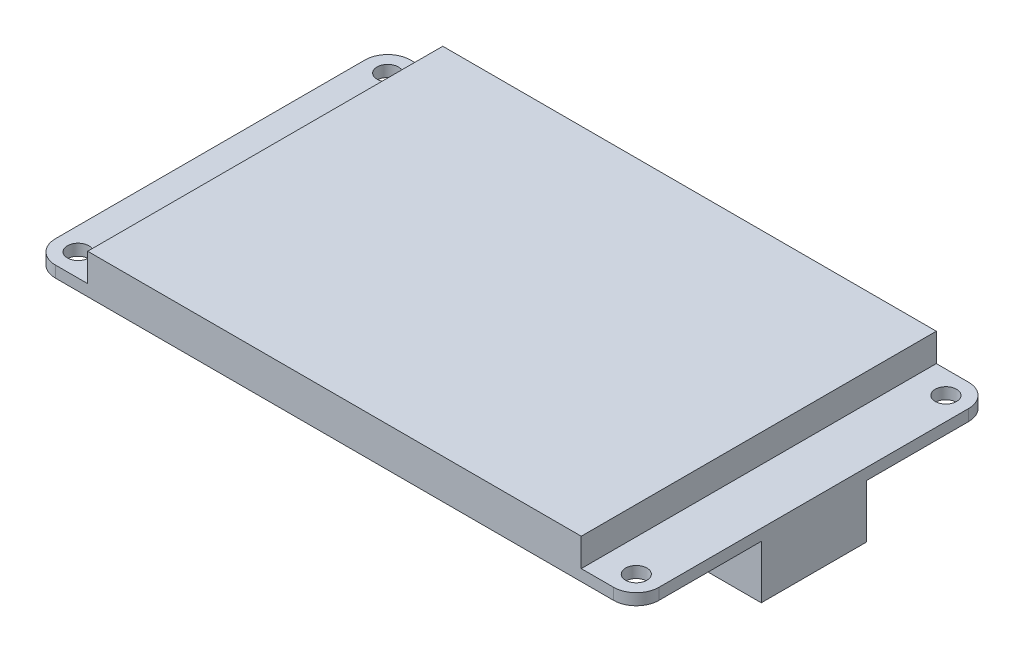
ISO-10303-21;
HEADER;
FILE_DESCRIPTION(('STEP AP214'),'2;1');
FILE_NAME('part.step','',(''),(''),'','','');
FILE_SCHEMA(('AUTOMOTIVE_DESIGN { 1 0 10303 214 1 1 1 1 }'));
ENDSEC;
DATA;
#1=APPLICATION_CONTEXT('core data for automotive mechanical design processes');
#2=APPLICATION_PROTOCOL_DEFINITION('international standard','automotive_design',2000,#1);
#3=PRODUCT_CONTEXT('',#1,'mechanical');
#4=PRODUCT('Part','Part','',(#3));
#5=PRODUCT_RELATED_PRODUCT_CATEGORY('part','',(#4));
#6=PRODUCT_DEFINITION_FORMATION('','',#4);
#7=PRODUCT_DEFINITION_CONTEXT('part definition',#1,'design');
#8=PRODUCT_DEFINITION('design','',#6,#7);
#9=PRODUCT_DEFINITION_SHAPE('','',#8);
#10=(LENGTH_UNIT() NAMED_UNIT(*) SI_UNIT(.MILLI.,.METRE.));
#11=(NAMED_UNIT(*) PLANE_ANGLE_UNIT() SI_UNIT($,.RADIAN.));
#12=(NAMED_UNIT(*) SI_UNIT($,.STERADIAN.) SOLID_ANGLE_UNIT());
#13=UNCERTAINTY_MEASURE_WITH_UNIT(LENGTH_MEASURE(1.E-05),#10,'distance_accuracy_value','');
#14=(GEOMETRIC_REPRESENTATION_CONTEXT(3) GLOBAL_UNCERTAINTY_ASSIGNED_CONTEXT((#13)) GLOBAL_UNIT_ASSIGNED_CONTEXT((#10,
#11,#12)) REPRESENTATION_CONTEXT('',''));
#15=CARTESIAN_POINT('',(0.,0.,0.));
#16=DIRECTION('',(0.,0.,1.));
#17=DIRECTION('',(1.,0.,0.));
#18=AXIS2_PLACEMENT_3D('',#15,#16,#17);
#19=CARTESIAN_POINT('',(0.,0.,0.));
#20=DIRECTION('',(0.,-1.,0.));
#21=DIRECTION('',(0.,0.,-1.));
#22=AXIS2_PLACEMENT_3D('',#19,#20,#21);
#23=PLANE('',#22);
#24=CARTESIAN_POINT('',(81.8,0.,-3.20000000000002));
#25=DIRECTION('',(0.,1.,0.));
#26=DIRECTION('',(0.,0.,1.));
#27=AXIS2_PLACEMENT_3D('',#24,#25,#26);
#28=CIRCLE('',#27,1.49999999999998);
#29=CARTESIAN_POINT('',(81.8,0.,-1.70000000000003));
#30=VERTEX_POINT('',#29);
#31=EDGE_CURVE('E257',#30,#30,#28,.T.);
#32=ORIENTED_EDGE('',*,*,#31,.T.);
#33=EDGE_LOOP('',(#32));
#34=FACE_BOUND('',#33,.T.);
#35=CARTESIAN_POINT('',(3.2,0.,-3.20000000000002));
#36=DIRECTION('',(0.,1.,0.));
#37=DIRECTION('',(0.,0.,-1.));
#38=AXIS2_PLACEMENT_3D('',#35,#36,#37);
#39=CIRCLE('',#38,1.5);
#40=CARTESIAN_POINT('',(3.2,0.,-4.70000000000002));
#41=VERTEX_POINT('',#40);
#42=EDGE_CURVE('E271',#41,#41,#39,.T.);
#43=ORIENTED_EDGE('',*,*,#42,.T.);
#44=EDGE_LOOP('',(#43));
#45=FACE_BOUND('',#44,.T.);
#46=CARTESIAN_POINT('',(81.8,0.,-46.8));
#47=DIRECTION('',(0.,1.,0.));
#48=DIRECTION('',(0.,0.,-1.));
#49=AXIS2_PLACEMENT_3D('',#46,#47,#48);
#50=CIRCLE('',#49,1.49999999999998);
#51=CARTESIAN_POINT('',(81.8,0.,-48.3));
#52=VERTEX_POINT('',#51);
#53=EDGE_CURVE('E241',#52,#52,#50,.T.);
#54=ORIENTED_EDGE('',*,*,#53,.T.);
#55=EDGE_LOOP('',(#54));
#56=FACE_BOUND('',#55,.T.);
#57=CARTESIAN_POINT('',(3.2,0.,-46.8));
#58=DIRECTION('',(0.,1.,0.));
#59=DIRECTION('',(0.,0.,1.));
#60=AXIS2_PLACEMENT_3D('',#57,#58,#59);
#61=CIRCLE('',#60,1.5);
#62=CARTESIAN_POINT('',(3.2,0.,-45.3));
#63=VERTEX_POINT('',#62);
#64=EDGE_CURVE('E299',#63,#63,#61,.T.);
#65=ORIENTED_EDGE('',*,*,#64,.T.);
#66=EDGE_LOOP('',(#65));
#67=FACE_BOUND('',#66,.T.);
#68=DIRECTION('',(1.,0.,0.));
#69=VECTOR('',#68,1.);
#70=CARTESIAN_POINT('',(31.0087140445048,0.,-20.4306303877755));
#71=LINE('',#70,#69);
#72=CARTESIAN_POINT('',(31.0087140445048,0.,-20.4306303877755));
#73=VERTEX_POINT('',#72);
#74=CARTESIAN_POINT('',(36.709115738963,0.,-20.4306303877755));
#75=VERTEX_POINT('',#74);
#76=EDGE_CURVE('E212',#73,#75,#71,.T.);
#77=ORIENTED_EDGE('',*,*,#76,.F.);
#78=DIRECTION('',(0.,0.,-1.));
#79=VECTOR('',#78,1.);
#80=CARTESIAN_POINT('',(31.0087140445048,0.,-3.32942530440073));
#81=LINE('',#80,#79);
#82=CARTESIAN_POINT('',(31.0087140445048,0.,-3.32942530440073));
#83=VERTEX_POINT('',#82);
#84=EDGE_CURVE('E209',#83,#73,#81,.T.);
#85=ORIENTED_EDGE('',*,*,#84,.F.);
#86=DIRECTION('',(-1.,0.,0.));
#87=VECTOR('',#86,1.);
#88=CARTESIAN_POINT('',(31.0087140445048,0.,-3.32942530440073));
#89=LINE('',#88,#87);
#90=CARTESIAN_POINT('',(36.709115738963,0.,-3.32942530440073));
#91=VERTEX_POINT('',#90);
#92=EDGE_CURVE('E222',#91,#83,#89,.T.);
#93=ORIENTED_EDGE('',*,*,#92,.F.);
#94=DIRECTION('',(0.,0.,1.));
#95=VECTOR('',#94,1.);
#96=CARTESIAN_POINT('',(36.709115738963,0.,-3.32942530440073));
#97=LINE('',#96,#95);
#98=EDGE_CURVE('E230',#75,#91,#97,.T.);
#99=ORIENTED_EDGE('',*,*,#98,.F.);
#100=EDGE_LOOP('',(#77,#85,#93,#99));
#101=FACE_BOUND('',#100,.T.);
#102=DIRECTION('',(0.,0.,-1.));
#103=VECTOR('',#102,1.);
#104=CARTESIAN_POINT('',(76.5,0.,-32.4));
#105=LINE('',#104,#103);
#106=CARTESIAN_POINT('',(76.5,0.,-17.6));
#107=VERTEX_POINT('',#106);
#108=CARTESIAN_POINT('',(76.5,0.,-32.4));
#109=VERTEX_POINT('',#108);
#110=EDGE_CURVE('E372',#107,#109,#105,.T.);
#111=ORIENTED_EDGE('',*,*,#110,.F.);
#112=DIRECTION('',(-1.,0.,0.));
#113=VECTOR('',#112,1.);
#114=CARTESIAN_POINT('',(85.,0.,-17.6));
#115=LINE('',#114,#113);
#116=CARTESIAN_POINT('',(85.,0.,-17.6));
#117=VERTEX_POINT('',#116);
#118=EDGE_CURVE('E371',#117,#107,#115,.T.);
#119=ORIENTED_EDGE('',*,*,#118,.F.);
#120=DIRECTION('',(0.,0.,-1.));
#121=VECTOR('',#120,1.);
#122=CARTESIAN_POINT('',(85.,0.,0.));
#123=LINE('',#122,#121);
#124=CARTESIAN_POINT('',(85.,0.,-3.20000000000002));
#125=VERTEX_POINT('',#124);
#126=EDGE_CURVE('E208',#125,#117,#123,.T.);
#127=ORIENTED_EDGE('',*,*,#126,.F.);
#128=CARTESIAN_POINT('',(81.8,0.,-3.20000000000002));
#129=DIRECTION('',(0.,-1.,0.));
#130=DIRECTION('',(0.,0.,1.));
#131=AXIS2_PLACEMENT_3D('',#128,#129,#130);
#132=CIRCLE('',#131,3.20000000000001);
#133=CARTESIAN_POINT('',(81.8,0.,0.));
#134=VERTEX_POINT('',#133);
#135=EDGE_CURVE('E251',#125,#134,#132,.T.);
#136=ORIENTED_EDGE('',*,*,#135,.T.);
#137=DIRECTION('',(1.,0.,0.));
#138=VECTOR('',#137,1.);
#139=CARTESIAN_POINT('',(0.,0.,0.));
#140=LINE('',#139,#138);
#141=CARTESIAN_POINT('',(3.20000000000001,0.,0.));
#142=VERTEX_POINT('',#141);
#143=EDGE_CURVE('E344',#142,#134,#140,.T.);
#144=ORIENTED_EDGE('',*,*,#143,.F.);
#145=CARTESIAN_POINT('',(3.2,0.,-3.20000000000002));
#146=DIRECTION('',(0.,-1.,0.));
#147=DIRECTION('',(0.,0.,-1.));
#148=AXIS2_PLACEMENT_3D('',#145,#146,#147);
#149=CIRCLE('',#148,3.2);
#150=CARTESIAN_POINT('',(0.,0.,-3.20000000000002));
#151=VERTEX_POINT('',#150);
#152=EDGE_CURVE('E294',#142,#151,#149,.T.);
#153=ORIENTED_EDGE('',*,*,#152,.T.);
#154=DIRECTION('',(0.,0.,1.));
#155=VECTOR('',#154,1.);
#156=CARTESIAN_POINT('',(0.,0.,0.));
#157=LINE('',#156,#155);
#158=CARTESIAN_POINT('',(0.,0.,-46.8));
#159=VERTEX_POINT('',#158);
#160=EDGE_CURVE('E323',#159,#151,#157,.T.);
#161=ORIENTED_EDGE('',*,*,#160,.F.);
#162=CARTESIAN_POINT('',(3.2,0.,-46.8));
#163=DIRECTION('',(0.,-1.,0.));
#164=DIRECTION('',(0.,0.,1.));
#165=AXIS2_PLACEMENT_3D('',#162,#163,#164);
#166=CIRCLE('',#165,3.2);
#167=CARTESIAN_POINT('',(3.20000000000001,0.,-50.));
#168=VERTEX_POINT('',#167);
#169=EDGE_CURVE('E282',#159,#168,#166,.T.);
#170=ORIENTED_EDGE('',*,*,#169,.T.);
#171=DIRECTION('',(-1.,0.,0.));
#172=VECTOR('',#171,1.);
#173=CARTESIAN_POINT('',(0.,0.,-50.));
#174=LINE('',#173,#172);
#175=CARTESIAN_POINT('',(81.8,0.,-50.));
#176=VERTEX_POINT('',#175);
#177=EDGE_CURVE('E49',#176,#168,#174,.T.);
#178=ORIENTED_EDGE('',*,*,#177,.F.);
#179=CARTESIAN_POINT('',(81.8,0.,-46.8));
#180=DIRECTION('',(0.,-1.,0.));
#181=DIRECTION('',(0.,0.,-1.));
#182=AXIS2_PLACEMENT_3D('',#179,#180,#181);
#183=CIRCLE('',#182,3.20000000000001);
#184=CARTESIAN_POINT('',(85.,0.,-46.8));
#185=VERTEX_POINT('',#184);
#186=EDGE_CURVE('E262',#176,#185,#183,.T.);
#187=ORIENTED_EDGE('',*,*,#186,.T.);
#188=CARTESIAN_POINT('',(85.,0.,-32.4));
#189=VERTEX_POINT('',#188);
#190=EDGE_CURVE('E346',#189,#185,#123,.T.);
#191=ORIENTED_EDGE('',*,*,#190,.F.);
#192=DIRECTION('',(1.,0.,0.));
#193=VECTOR('',#192,1.);
#194=CARTESIAN_POINT('',(85.,0.,-32.4));
#195=LINE('',#194,#193);
#196=EDGE_CURVE('E201',#109,#189,#195,.T.);
#197=ORIENTED_EDGE('',*,*,#196,.F.);
#198=EDGE_LOOP('',(#111,#119,#127,#136,#144,#153,#161,#170,#178,#187,#191,#197));
#199=FACE_BOUND('',#198,.T.);
#200=ADVANCED_FACE('F45',(#34,#45,#56,#67,#101,#199),#23,.T.);
#201=CARTESIAN_POINT('',(0.,5.55,0.));
#202=DIRECTION('',(1.,0.,0.));
#203=DIRECTION('',(0.,0.,-1.));
#204=AXIS2_PLACEMENT_3D('',#201,#202,#203);
#205=PLANE('',#204);
#206=DIRECTION('',(0.,1.,0.));
#207=VECTOR('',#206,1.);
#208=CARTESIAN_POINT('',(0.,0.,-3.20000000000002));
#209=LINE('',#208,#207);
#210=CARTESIAN_POINT('',(0.,1.6,-3.20000000000002));
#211=VERTEX_POINT('',#210);
#212=EDGE_CURVE('E291',#151,#211,#209,.T.);
#213=ORIENTED_EDGE('',*,*,#212,.T.);
#214=DIRECTION('',(0.,0.,1.));
#215=VECTOR('',#214,1.);
#216=CARTESIAN_POINT('',(0.,1.6,-50.));
#217=LINE('',#216,#215);
#218=CARTESIAN_POINT('',(0.,1.6,-46.8));
#219=VERTEX_POINT('',#218);
#220=EDGE_CURVE('E311',#219,#211,#217,.T.);
#221=ORIENTED_EDGE('',*,*,#220,.F.);
#222=DIRECTION('',(0.,1.,0.));
#223=VECTOR('',#222,1.);
#224=CARTESIAN_POINT('',(0.,0.,-46.8));
#225=LINE('',#224,#223);
#226=EDGE_CURVE('E283',#159,#219,#225,.T.);
#227=ORIENTED_EDGE('',*,*,#226,.F.);
#228=ORIENTED_EDGE('',*,*,#160,.T.);
#229=EDGE_LOOP('',(#213,#221,#227,#228));
#230=FACE_BOUND('',#229,.T.);
#231=ADVANCED_FACE('F47',(#230),#205,.F.);
#232=CARTESIAN_POINT('',(0.,5.55,0.));
#233=DIRECTION('',(0.,0.,-1.));
#234=DIRECTION('',(-1.,0.,0.));
#235=AXIS2_PLACEMENT_3D('',#232,#233,#234);
#236=PLANE('',#235);
#237=DIRECTION('',(1.,0.,0.));
#238=VECTOR('',#237,1.);
#239=CARTESIAN_POINT('',(0.,1.6,0.));
#240=LINE('',#239,#238);
#241=CARTESIAN_POINT('',(3.20000000000001,1.6,0.));
#242=VERTEX_POINT('',#241);
#243=CARTESIAN_POINT('',(7.75,1.6,0.));
#244=VERTEX_POINT('',#243);
#245=EDGE_CURVE('E316',#242,#244,#240,.T.);
#246=ORIENTED_EDGE('',*,*,#245,.F.);
#247=DIRECTION('',(0.,1.,0.));
#248=VECTOR('',#247,1.);
#249=CARTESIAN_POINT('',(3.20000000000001,0.,0.));
#250=LINE('',#249,#248);
#251=EDGE_CURVE('E270',#142,#242,#250,.T.);
#252=ORIENTED_EDGE('',*,*,#251,.F.);
#253=ORIENTED_EDGE('',*,*,#143,.T.);
#254=DIRECTION('',(0.,1.,0.));
#255=VECTOR('',#254,1.);
#256=CARTESIAN_POINT('',(81.8,0.,0.));
#257=LINE('',#256,#255);
#258=CARTESIAN_POINT('',(81.8,1.6,0.));
#259=VERTEX_POINT('',#258);
#260=EDGE_CURVE('E248',#134,#259,#257,.T.);
#261=ORIENTED_EDGE('',*,*,#260,.T.);
#262=DIRECTION('',(1.,0.,0.));
#263=VECTOR('',#262,1.);
#264=CARTESIAN_POINT('',(77.25,1.6,0.));
#265=LINE('',#264,#263);
#266=CARTESIAN_POINT('',(77.25,1.6,0.));
#267=VERTEX_POINT('',#266);
#268=EDGE_CURVE('E302',#267,#259,#265,.T.);
#269=ORIENTED_EDGE('',*,*,#268,.F.);
#270=DIRECTION('',(0.,1.,0.));
#271=VECTOR('',#270,1.);
#272=CARTESIAN_POINT('',(77.25,-50.5970601912799,0.));
#273=LINE('',#272,#271);
#274=CARTESIAN_POINT('',(77.25,5.55,0.));
#275=VERTEX_POINT('',#274);
#276=EDGE_CURVE('E328',#267,#275,#273,.T.);
#277=ORIENTED_EDGE('',*,*,#276,.T.);
#278=DIRECTION('',(1.,0.,0.));
#279=VECTOR('',#278,1.);
#280=CARTESIAN_POINT('',(0.,5.55,0.));
#281=LINE('',#280,#279);
#282=CARTESIAN_POINT('',(7.74999999999999,5.55,0.));
#283=VERTEX_POINT('',#282);
#284=EDGE_CURVE('E54',#283,#275,#281,.T.);
#285=ORIENTED_EDGE('',*,*,#284,.F.);
#286=DIRECTION('',(0.,1.,0.));
#287=VECTOR('',#286,1.);
#288=CARTESIAN_POINT('',(7.75,-50.5970601912799,0.));
#289=LINE('',#288,#287);
#290=EDGE_CURVE('E315',#244,#283,#289,.T.);
#291=ORIENTED_EDGE('',*,*,#290,.F.);
#292=EDGE_LOOP('',(#246,#252,#253,#261,#269,#277,#285,#291));
#293=FACE_BOUND('',#292,.T.);
#294=ADVANCED_FACE('F400',(#293),#236,.F.);
#295=CARTESIAN_POINT('',(85.,5.55,0.));
#296=DIRECTION('',(-1.,0.,0.));
#297=DIRECTION('',(0.,0.,1.));
#298=AXIS2_PLACEMENT_3D('',#295,#296,#297);
#299=PLANE('',#298);
#300=DIRECTION('',(0.,1.,0.));
#301=VECTOR('',#300,1.);
#302=CARTESIAN_POINT('',(85.,0.,-46.8));
#303=LINE('',#302,#301);
#304=CARTESIAN_POINT('',(85.,1.6,-46.8));
#305=VERTEX_POINT('',#304);
#306=EDGE_CURVE('E260',#185,#305,#303,.T.);
#307=ORIENTED_EDGE('',*,*,#306,.T.);
#308=DIRECTION('',(0.,0.,-1.));
#309=VECTOR('',#308,1.);
#310=CARTESIAN_POINT('',(85.,1.6,-50.));
#311=LINE('',#310,#309);
#312=CARTESIAN_POINT('',(85.,1.6,-3.20000000000002));
#313=VERTEX_POINT('',#312);
#314=EDGE_CURVE('E332',#313,#305,#311,.T.);
#315=ORIENTED_EDGE('',*,*,#314,.F.);
#316=DIRECTION('',(0.,1.,0.));
#317=VECTOR('',#316,1.);
#318=CARTESIAN_POINT('',(85.,0.,-3.20000000000002));
#319=LINE('',#318,#317);
#320=EDGE_CURVE('E252',#125,#313,#319,.T.);
#321=ORIENTED_EDGE('',*,*,#320,.F.);
#322=ORIENTED_EDGE('',*,*,#126,.T.);
#323=DIRECTION('',(0.,1.,0.));
#324=VECTOR('',#323,1.);
#325=CARTESIAN_POINT('',(85.,-7.5,-17.6));
#326=LINE('',#325,#324);
#327=CARTESIAN_POINT('',(85.,-7.5,-17.6));
#328=VERTEX_POINT('',#327);
#329=EDGE_CURVE('E189',#328,#117,#326,.T.);
#330=ORIENTED_EDGE('',*,*,#329,.F.);
#331=DIRECTION('',(0.,0.,1.));
#332=VECTOR('',#331,1.);
#333=CARTESIAN_POINT('',(85.,-7.5,-32.4));
#334=LINE('',#333,#332);
#335=CARTESIAN_POINT('',(85.,-7.5,-32.4));
#336=VERTEX_POINT('',#335);
#337=EDGE_CURVE('E196',#336,#328,#334,.T.);
#338=ORIENTED_EDGE('',*,*,#337,.F.);
#339=DIRECTION('',(0.,1.,0.));
#340=VECTOR('',#339,1.);
#341=CARTESIAN_POINT('',(85.,-7.5,-32.4));
#342=LINE('',#341,#340);
#343=EDGE_CURVE('E62',#336,#189,#342,.T.);
#344=ORIENTED_EDGE('',*,*,#343,.T.);
#345=ORIENTED_EDGE('',*,*,#190,.T.);
#346=EDGE_LOOP('',(#307,#315,#321,#322,#330,#338,#344,#345));
#347=FACE_BOUND('',#346,.T.);
#348=ADVANCED_FACE('F205',(#347),#299,.F.);
#349=CARTESIAN_POINT('',(0.,5.55,-50.));
#350=DIRECTION('',(0.,0.,1.));
#351=DIRECTION('',(1.,0.,0.));
#352=AXIS2_PLACEMENT_3D('',#349,#350,#351);
#353=PLANE('',#352);
#354=DIRECTION('',(0.,1.,0.));
#355=VECTOR('',#354,1.);
#356=CARTESIAN_POINT('',(3.20000000000001,0.,-50.));
#357=LINE('',#356,#355);
#358=CARTESIAN_POINT('',(3.20000000000001,1.6,-50.));
#359=VERTEX_POINT('',#358);
#360=EDGE_CURVE('E279',#168,#359,#357,.T.);
#361=ORIENTED_EDGE('',*,*,#360,.T.);
#362=DIRECTION('',(-1.,0.,0.));
#363=VECTOR('',#362,1.);
#364=CARTESIAN_POINT('',(0.,1.6,-50.));
#365=LINE('',#364,#363);
#366=CARTESIAN_POINT('',(7.74999999999999,1.6,-50.));
#367=VERTEX_POINT('',#366);
#368=EDGE_CURVE('E307',#367,#359,#365,.T.);
#369=ORIENTED_EDGE('',*,*,#368,.F.);
#370=DIRECTION('',(0.,1.,0.));
#371=VECTOR('',#370,1.);
#372=CARTESIAN_POINT('',(7.74999999999999,-50.5970601912799,-50.));
#373=LINE('',#372,#371);
#374=CARTESIAN_POINT('',(7.74999999999999,5.55,-50.));
#375=VERTEX_POINT('',#374);
#376=EDGE_CURVE('E314',#367,#375,#373,.T.);
#377=ORIENTED_EDGE('',*,*,#376,.T.);
#378=DIRECTION('',(-1.,0.,0.));
#379=VECTOR('',#378,1.);
#380=CARTESIAN_POINT('',(0.,5.55,-50.));
#381=LINE('',#380,#379);
#382=CARTESIAN_POINT('',(77.25,5.55,-50.));
#383=VERTEX_POINT('',#382);
#384=EDGE_CURVE('E12',#383,#375,#381,.T.);
#385=ORIENTED_EDGE('',*,*,#384,.F.);
#386=DIRECTION('',(0.,1.,0.));
#387=VECTOR('',#386,1.);
#388=CARTESIAN_POINT('',(77.25,-50.5970601912799,-50.));
#389=LINE('',#388,#387);
#390=CARTESIAN_POINT('',(77.25,1.6,-50.));
#391=VERTEX_POINT('',#390);
#392=EDGE_CURVE('E324',#391,#383,#389,.T.);
#393=ORIENTED_EDGE('',*,*,#392,.F.);
#394=DIRECTION('',(-1.,0.,0.));
#395=VECTOR('',#394,1.);
#396=CARTESIAN_POINT('',(77.25,1.6,-50.));
#397=LINE('',#396,#395);
#398=CARTESIAN_POINT('',(81.8,1.6,-50.));
#399=VERTEX_POINT('',#398);
#400=EDGE_CURVE('E326',#399,#391,#397,.T.);
#401=ORIENTED_EDGE('',*,*,#400,.F.);
#402=DIRECTION('',(0.,1.,0.));
#403=VECTOR('',#402,1.);
#404=CARTESIAN_POINT('',(81.8,0.,-50.));
#405=LINE('',#404,#403);
#406=EDGE_CURVE('E245',#176,#399,#405,.T.);
#407=ORIENTED_EDGE('',*,*,#406,.F.);
#408=ORIENTED_EDGE('',*,*,#177,.T.);
#409=EDGE_LOOP('',(#361,#369,#377,#385,#393,#401,#407,#408));
#410=FACE_BOUND('',#409,.T.);
#411=ADVANCED_FACE('F361',(#410),#353,.F.);
#412=CARTESIAN_POINT('',(0.,5.55,0.));
#413=DIRECTION('',(0.,-1.,0.));
#414=DIRECTION('',(0.,0.,-1.));
#415=AXIS2_PLACEMENT_3D('',#412,#413,#414);
#416=PLANE('',#415);
#417=ORIENTED_EDGE('',*,*,#384,.T.);
#418=DIRECTION('',(0.,0.,-1.));
#419=VECTOR('',#418,1.);
#420=CARTESIAN_POINT('',(7.74999999999999,5.55,-50.));
#421=LINE('',#420,#419);
#422=EDGE_CURVE('E305',#283,#375,#421,.T.);
#423=ORIENTED_EDGE('',*,*,#422,.F.);
#424=ORIENTED_EDGE('',*,*,#284,.T.);
#425=DIRECTION('',(0.,0.,1.));
#426=VECTOR('',#425,1.);
#427=CARTESIAN_POINT('',(77.25,5.55,-50.));
#428=LINE('',#427,#426);
#429=EDGE_CURVE('E308',#383,#275,#428,.T.);
#430=ORIENTED_EDGE('',*,*,#429,.F.);
#431=EDGE_LOOP('',(#417,#423,#424,#430));
#432=FACE_BOUND('',#431,.T.);
#433=ADVANCED_FACE('F405',(#432),#416,.F.);
#434=CARTESIAN_POINT('',(0.,1.6,0.));
#435=DIRECTION('',(0.,-1.,0.));
#436=DIRECTION('',(0.,0.,-1.));
#437=AXIS2_PLACEMENT_3D('',#434,#435,#436);
#438=PLANE('',#437);
#439=CARTESIAN_POINT('',(81.8,1.6,-3.20000000000002));
#440=DIRECTION('',(0.,1.,0.));
#441=DIRECTION('',(0.,0.,1.));
#442=AXIS2_PLACEMENT_3D('',#439,#440,#441);
#443=CIRCLE('',#442,1.49999999999998);
#444=CARTESIAN_POINT('',(81.8,1.6,-1.70000000000003));
#445=VERTEX_POINT('',#444);
#446=EDGE_CURVE('E274',#445,#445,#443,.T.);
#447=ORIENTED_EDGE('',*,*,#446,.F.);
#448=EDGE_LOOP('',(#447));
#449=FACE_BOUND('',#448,.T.);
#450=CARTESIAN_POINT('',(81.8,1.6,-46.8));
#451=DIRECTION('',(0.,1.,0.));
#452=DIRECTION('',(0.,0.,-1.));
#453=AXIS2_PLACEMENT_3D('',#450,#451,#452);
#454=CIRCLE('',#453,1.49999999999998);
#455=CARTESIAN_POINT('',(81.8,1.6,-48.3));
#456=VERTEX_POINT('',#455);
#457=EDGE_CURVE('E242',#456,#456,#454,.T.);
#458=ORIENTED_EDGE('',*,*,#457,.F.);
#459=EDGE_LOOP('',(#458));
#460=FACE_BOUND('',#459,.T.);
#461=ORIENTED_EDGE('',*,*,#314,.T.);
#462=CARTESIAN_POINT('',(81.8,1.6,-46.8));
#463=DIRECTION('',(0.,-1.,0.));
#464=DIRECTION('',(0.,0.,-1.));
#465=AXIS2_PLACEMENT_3D('',#462,#463,#464);
#466=CIRCLE('',#465,3.20000000000001);
#467=EDGE_CURVE('E254',#399,#305,#466,.T.);
#468=ORIENTED_EDGE('',*,*,#467,.F.);
#469=ORIENTED_EDGE('',*,*,#400,.T.);
#470=DIRECTION('',(0.,0.,1.));
#471=VECTOR('',#470,1.);
#472=CARTESIAN_POINT('',(77.25,1.6,-50.));
#473=LINE('',#472,#471);
#474=EDGE_CURVE('E327',#391,#267,#473,.T.);
#475=ORIENTED_EDGE('',*,*,#474,.T.);
#476=ORIENTED_EDGE('',*,*,#268,.T.);
#477=CARTESIAN_POINT('',(81.8,1.6,-3.20000000000002));
#478=DIRECTION('',(0.,-1.,0.));
#479=DIRECTION('',(0.,0.,1.));
#480=AXIS2_PLACEMENT_3D('',#477,#478,#479);
#481=CIRCLE('',#480,3.20000000000001);
#482=EDGE_CURVE('E255',#313,#259,#481,.T.);
#483=ORIENTED_EDGE('',*,*,#482,.F.);
#484=EDGE_LOOP('',(#461,#468,#469,#475,#476,#483));
#485=FACE_BOUND('',#484,.T.);
#486=ADVANCED_FACE('F366',(#449,#460,#485),#438,.F.);
#487=CARTESIAN_POINT('',(77.25,-50.5970601912799,-50.));
#488=DIRECTION('',(-1.,0.,0.));
#489=DIRECTION('',(0.,0.,1.));
#490=AXIS2_PLACEMENT_3D('',#487,#488,#489);
#491=PLANE('',#490);
#492=ORIENTED_EDGE('',*,*,#392,.T.);
#493=ORIENTED_EDGE('',*,*,#429,.T.);
#494=ORIENTED_EDGE('',*,*,#276,.F.);
#495=ORIENTED_EDGE('',*,*,#474,.F.);
#496=EDGE_LOOP('',(#492,#493,#494,#495));
#497=FACE_BOUND('',#496,.T.);
#498=ADVANCED_FACE('F435',(#497),#491,.F.);
#499=CARTESIAN_POINT('',(0.,1.6,0.));
#500=DIRECTION('',(0.,-1.,0.));
#501=DIRECTION('',(0.,0.,-1.));
#502=AXIS2_PLACEMENT_3D('',#499,#500,#501);
#503=PLANE('',#502);
#504=CARTESIAN_POINT('',(3.2,1.6,-3.20000000000002));
#505=DIRECTION('',(0.,1.,0.));
#506=DIRECTION('',(0.,0.,-1.));
#507=AXIS2_PLACEMENT_3D('',#504,#505,#506);
#508=CIRCLE('',#507,1.5);
#509=CARTESIAN_POINT('',(3.2,1.6,-4.70000000000002));
#510=VERTEX_POINT('',#509);
#511=EDGE_CURVE('E267',#510,#510,#508,.T.);
#512=ORIENTED_EDGE('',*,*,#511,.F.);
#513=EDGE_LOOP('',(#512));
#514=FACE_BOUND('',#513,.T.);
#515=CARTESIAN_POINT('',(3.2,1.6,-46.8));
#516=DIRECTION('',(0.,1.,0.));
#517=DIRECTION('',(0.,0.,1.));
#518=AXIS2_PLACEMENT_3D('',#515,#516,#517);
#519=CIRCLE('',#518,1.5);
#520=CARTESIAN_POINT('',(3.2,1.6,-45.3));
#521=VERTEX_POINT('',#520);
#522=EDGE_CURVE('E288',#521,#521,#519,.T.);
#523=ORIENTED_EDGE('',*,*,#522,.F.);
#524=EDGE_LOOP('',(#523));
#525=FACE_BOUND('',#524,.T.);
#526=ORIENTED_EDGE('',*,*,#220,.T.);
#527=CARTESIAN_POINT('',(3.2,1.6,-3.20000000000002));
#528=DIRECTION('',(0.,-1.,0.));
#529=DIRECTION('',(0.,0.,-1.));
#530=AXIS2_PLACEMENT_3D('',#527,#528,#529);
#531=CIRCLE('',#530,3.2);
#532=EDGE_CURVE('E285',#242,#211,#531,.T.);
#533=ORIENTED_EDGE('',*,*,#532,.F.);
#534=ORIENTED_EDGE('',*,*,#245,.T.);
#535=DIRECTION('',(0.,0.,-1.));
#536=VECTOR('',#535,1.);
#537=CARTESIAN_POINT('',(7.74999999999999,1.6,-50.));
#538=LINE('',#537,#536);
#539=EDGE_CURVE('E312',#244,#367,#538,.T.);
#540=ORIENTED_EDGE('',*,*,#539,.T.);
#541=ORIENTED_EDGE('',*,*,#368,.T.);
#542=CARTESIAN_POINT('',(3.2,1.6,-46.8));
#543=DIRECTION('',(0.,-1.,0.));
#544=DIRECTION('',(0.,0.,1.));
#545=AXIS2_PLACEMENT_3D('',#542,#543,#544);
#546=CIRCLE('',#545,3.2);
#547=EDGE_CURVE('E286',#219,#359,#546,.T.);
#548=ORIENTED_EDGE('',*,*,#547,.F.);
#549=EDGE_LOOP('',(#526,#533,#534,#540,#541,#548));
#550=FACE_BOUND('',#549,.T.);
#551=ADVANCED_FACE('F421',(#514,#525,#550),#503,.F.);
#552=CARTESIAN_POINT('',(7.74999999999999,-50.5970601912799,-50.));
#553=DIRECTION('',(1.,0.,0.));
#554=DIRECTION('',(0.,0.,-1.));
#555=AXIS2_PLACEMENT_3D('',#552,#553,#554);
#556=PLANE('',#555);
#557=ORIENTED_EDGE('',*,*,#290,.T.);
#558=ORIENTED_EDGE('',*,*,#422,.T.);
#559=ORIENTED_EDGE('',*,*,#376,.F.);
#560=ORIENTED_EDGE('',*,*,#539,.F.);
#561=EDGE_LOOP('',(#557,#558,#559,#560));
#562=FACE_BOUND('',#561,.T.);
#563=ADVANCED_FACE('F424',(#562),#556,.F.);
#564=CARTESIAN_POINT('',(3.2,0.,-46.8));
#565=DIRECTION('',(0.,1.,0.));
#566=DIRECTION('',(0.,0.,1.));
#567=AXIS2_PLACEMENT_3D('',#564,#565,#566);
#568=CYLINDRICAL_SURFACE('',#567,1.5);
#569=ORIENTED_EDGE('',*,*,#64,.F.);
#570=EDGE_LOOP('',(#569));
#571=FACE_BOUND('',#570,.T.);
#572=ORIENTED_EDGE('',*,*,#522,.T.);
#573=EDGE_LOOP('',(#572));
#574=FACE_BOUND('',#573,.T.);
#575=ADVANCED_FACE('F455',(#571,#574),#568,.F.);
#576=CARTESIAN_POINT('',(3.2,0.,-46.8));
#577=DIRECTION('',(0.,1.,0.));
#578=DIRECTION('',(0.,0.,1.));
#579=AXIS2_PLACEMENT_3D('',#576,#577,#578);
#580=CYLINDRICAL_SURFACE('',#579,3.2);
#581=ORIENTED_EDGE('',*,*,#547,.T.);
#582=ORIENTED_EDGE('',*,*,#360,.F.);
#583=ORIENTED_EDGE('',*,*,#169,.F.);
#584=ORIENTED_EDGE('',*,*,#226,.T.);
#585=EDGE_LOOP('',(#581,#582,#583,#584));
#586=FACE_BOUND('',#585,.T.);
#587=ADVANCED_FACE('F458',(#586),#580,.T.);
#588=CARTESIAN_POINT('',(3.2,0.,-3.20000000000002));
#589=DIRECTION('',(0.,1.,0.));
#590=DIRECTION('',(0.,0.,1.));
#591=AXIS2_PLACEMENT_3D('',#588,#589,#590);
#592=CYLINDRICAL_SURFACE('',#591,3.2);
#593=ORIENTED_EDGE('',*,*,#532,.T.);
#594=ORIENTED_EDGE('',*,*,#212,.F.);
#595=ORIENTED_EDGE('',*,*,#152,.F.);
#596=ORIENTED_EDGE('',*,*,#251,.T.);
#597=EDGE_LOOP('',(#593,#594,#595,#596));
#598=FACE_BOUND('',#597,.T.);
#599=ADVANCED_FACE('F432',(#598),#592,.T.);
#600=CARTESIAN_POINT('',(3.2,0.,-3.20000000000002));
#601=DIRECTION('',(0.,1.,0.));
#602=DIRECTION('',(0.,0.,1.));
#603=AXIS2_PLACEMENT_3D('',#600,#601,#602);
#604=CYLINDRICAL_SURFACE('',#603,1.5);
#605=ORIENTED_EDGE('',*,*,#42,.F.);
#606=EDGE_LOOP('',(#605));
#607=FACE_BOUND('',#606,.T.);
#608=ORIENTED_EDGE('',*,*,#511,.T.);
#609=EDGE_LOOP('',(#608));
#610=FACE_BOUND('',#609,.T.);
#611=ADVANCED_FACE('F462',(#607,#610),#604,.F.);
#612=CARTESIAN_POINT('',(81.8,0.,-3.20000000000002));
#613=DIRECTION('',(0.,1.,0.));
#614=DIRECTION('',(0.,0.,1.));
#615=AXIS2_PLACEMENT_3D('',#612,#613,#614);
#616=CYLINDRICAL_SURFACE('',#615,3.20000000000001);
#617=ORIENTED_EDGE('',*,*,#482,.T.);
#618=ORIENTED_EDGE('',*,*,#260,.F.);
#619=ORIENTED_EDGE('',*,*,#135,.F.);
#620=ORIENTED_EDGE('',*,*,#320,.T.);
#621=EDGE_LOOP('',(#617,#618,#619,#620));
#622=FACE_BOUND('',#621,.T.);
#623=ADVANCED_FACE('F473',(#622),#616,.T.);
#624=CARTESIAN_POINT('',(81.8,0.,-46.8));
#625=DIRECTION('',(0.,1.,0.));
#626=DIRECTION('',(0.,0.,1.));
#627=AXIS2_PLACEMENT_3D('',#624,#625,#626);
#628=CYLINDRICAL_SURFACE('',#627,3.20000000000001);
#629=ORIENTED_EDGE('',*,*,#467,.T.);
#630=ORIENTED_EDGE('',*,*,#306,.F.);
#631=ORIENTED_EDGE('',*,*,#186,.F.);
#632=ORIENTED_EDGE('',*,*,#406,.T.);
#633=EDGE_LOOP('',(#629,#630,#631,#632));
#634=FACE_BOUND('',#633,.T.);
#635=ADVANCED_FACE('F354',(#634),#628,.T.);
#636=CARTESIAN_POINT('',(81.8,0.,-46.8));
#637=DIRECTION('',(0.,1.,0.));
#638=DIRECTION('',(0.,0.,1.));
#639=AXIS2_PLACEMENT_3D('',#636,#637,#638);
#640=CYLINDRICAL_SURFACE('',#639,1.49999999999998);
#641=ORIENTED_EDGE('',*,*,#53,.F.);
#642=EDGE_LOOP('',(#641));
#643=FACE_BOUND('',#642,.T.);
#644=ORIENTED_EDGE('',*,*,#457,.T.);
#645=EDGE_LOOP('',(#644));
#646=FACE_BOUND('',#645,.T.);
#647=ADVANCED_FACE('F469',(#643,#646),#640,.F.);
#648=CARTESIAN_POINT('',(81.8,0.,-3.20000000000002));
#649=DIRECTION('',(0.,1.,0.));
#650=DIRECTION('',(0.,0.,1.));
#651=AXIS2_PLACEMENT_3D('',#648,#649,#650);
#652=CYLINDRICAL_SURFACE('',#651,1.49999999999998);
#653=ORIENTED_EDGE('',*,*,#31,.F.);
#654=EDGE_LOOP('',(#653));
#655=FACE_BOUND('',#654,.T.);
#656=ORIENTED_EDGE('',*,*,#446,.T.);
#657=EDGE_LOOP('',(#656));
#658=FACE_BOUND('',#657,.T.);
#659=ADVANCED_FACE('F465',(#655,#658),#652,.F.);
#660=CARTESIAN_POINT('',(31.0087140445048,-3.,-3.32942530440073));
#661=DIRECTION('',(1.,0.,0.));
#662=DIRECTION('',(0.,0.,-1.));
#663=AXIS2_PLACEMENT_3D('',#660,#661,#662);
#664=PLANE('',#663);
#665=ORIENTED_EDGE('',*,*,#84,.T.);
#666=DIRECTION('',(0.,1.,0.));
#667=VECTOR('',#666,1.);
#668=CARTESIAN_POINT('',(31.0087140445048,-3.,-20.4306303877755));
#669=LINE('',#668,#667);
#670=CARTESIAN_POINT('',(31.0087140445048,-3.,-20.4306303877755));
#671=VERTEX_POINT('',#670);
#672=EDGE_CURVE('E239',#671,#73,#669,.T.);
#673=ORIENTED_EDGE('',*,*,#672,.F.);
#674=DIRECTION('',(0.,0.,-1.));
#675=VECTOR('',#674,1.);
#676=CARTESIAN_POINT('',(31.0087140445048,-3.,-3.32942530440073));
#677=LINE('',#676,#675);
#678=CARTESIAN_POINT('',(31.0087140445048,-3.,-3.32942530440073));
#679=VERTEX_POINT('',#678);
#680=EDGE_CURVE('E218',#679,#671,#677,.T.);
#681=ORIENTED_EDGE('',*,*,#680,.F.);
#682=DIRECTION('',(0.,1.,0.));
#683=VECTOR('',#682,1.);
#684=CARTESIAN_POINT('',(31.0087140445048,-3.,-3.32942530440073));
#685=LINE('',#684,#683);
#686=EDGE_CURVE('E227',#679,#83,#685,.T.);
#687=ORIENTED_EDGE('',*,*,#686,.T.);
#688=EDGE_LOOP('',(#665,#673,#681,#687));
#689=FACE_BOUND('',#688,.T.);
#690=ADVANCED_FACE('F468',(#689),#664,.F.);
#691=CARTESIAN_POINT('',(31.0087140445048,-3.,-20.4306303877755));
#692=DIRECTION('',(0.,0.,1.));
#693=DIRECTION('',(1.,0.,0.));
#694=AXIS2_PLACEMENT_3D('',#691,#692,#693);
#695=PLANE('',#694);
#696=ORIENTED_EDGE('',*,*,#76,.T.);
#697=DIRECTION('',(0.,1.,0.));
#698=VECTOR('',#697,1.);
#699=CARTESIAN_POINT('',(36.709115738963,-3.,-20.4306303877755));
#700=LINE('',#699,#698);
#701=CARTESIAN_POINT('',(36.709115738963,-3.,-20.4306303877755));
#702=VERTEX_POINT('',#701);
#703=EDGE_CURVE('E236',#702,#75,#700,.T.);
#704=ORIENTED_EDGE('',*,*,#703,.F.);
#705=DIRECTION('',(1.,0.,0.));
#706=VECTOR('',#705,1.);
#707=CARTESIAN_POINT('',(31.0087140445048,-3.,-20.4306303877755));
#708=LINE('',#707,#706);
#709=EDGE_CURVE('E221',#671,#702,#708,.T.);
#710=ORIENTED_EDGE('',*,*,#709,.F.);
#711=ORIENTED_EDGE('',*,*,#672,.T.);
#712=EDGE_LOOP('',(#696,#704,#710,#711));
#713=FACE_BOUND('',#712,.T.);
#714=ADVANCED_FACE('F484',(#713),#695,.F.);
#715=CARTESIAN_POINT('',(36.709115738963,-3.,-3.32942530440073));
#716=DIRECTION('',(-1.,0.,0.));
#717=DIRECTION('',(0.,0.,1.));
#718=AXIS2_PLACEMENT_3D('',#715,#716,#717);
#719=PLANE('',#718);
#720=ORIENTED_EDGE('',*,*,#98,.T.);
#721=DIRECTION('',(0.,1.,0.));
#722=VECTOR('',#721,1.);
#723=CARTESIAN_POINT('',(36.709115738963,-3.,-3.32942530440073));
#724=LINE('',#723,#722);
#725=CARTESIAN_POINT('',(36.709115738963,-3.,-3.32942530440073));
#726=VERTEX_POINT('',#725);
#727=EDGE_CURVE('E70',#726,#91,#724,.T.);
#728=ORIENTED_EDGE('',*,*,#727,.F.);
#729=DIRECTION('',(0.,0.,1.));
#730=VECTOR('',#729,1.);
#731=CARTESIAN_POINT('',(36.709115738963,-3.,-3.32942530440073));
#732=LINE('',#731,#730);
#733=EDGE_CURVE('E224',#702,#726,#732,.T.);
#734=ORIENTED_EDGE('',*,*,#733,.F.);
#735=ORIENTED_EDGE('',*,*,#703,.T.);
#736=EDGE_LOOP('',(#720,#728,#734,#735));
#737=FACE_BOUND('',#736,.T.);
#738=ADVANCED_FACE('F488',(#737),#719,.F.);
#739=CARTESIAN_POINT('',(31.0087140445048,-3.,-3.32942530440073));
#740=DIRECTION('',(0.,0.,-1.));
#741=DIRECTION('',(-1.,0.,0.));
#742=AXIS2_PLACEMENT_3D('',#739,#740,#741);
#743=PLANE('',#742);
#744=ORIENTED_EDGE('',*,*,#92,.T.);
#745=ORIENTED_EDGE('',*,*,#686,.F.);
#746=DIRECTION('',(-1.,0.,0.));
#747=VECTOR('',#746,1.);
#748=CARTESIAN_POINT('',(31.0087140445048,-3.,-3.32942530440073));
#749=LINE('',#748,#747);
#750=EDGE_CURVE('E226',#726,#679,#749,.T.);
#751=ORIENTED_EDGE('',*,*,#750,.F.);
#752=ORIENTED_EDGE('',*,*,#727,.T.);
#753=EDGE_LOOP('',(#744,#745,#751,#752));
#754=FACE_BOUND('',#753,.T.);
#755=ADVANCED_FACE('F492',(#754),#743,.F.);
#756=CARTESIAN_POINT('',(0.,-3.,0.));
#757=DIRECTION('',(0.,-1.,0.));
#758=DIRECTION('',(0.,0.,-1.));
#759=AXIS2_PLACEMENT_3D('',#756,#757,#758);
#760=PLANE('',#759);
#761=ORIENTED_EDGE('',*,*,#680,.T.);
#762=ORIENTED_EDGE('',*,*,#709,.T.);
#763=ORIENTED_EDGE('',*,*,#733,.T.);
#764=ORIENTED_EDGE('',*,*,#750,.T.);
#765=EDGE_LOOP('',(#761,#762,#763,#764));
#766=FACE_BOUND('',#765,.T.);
#767=ADVANCED_FACE('F392',(#766),#760,.T.);
#768=CARTESIAN_POINT('',(85.,-7.5,-17.6));
#769=DIRECTION('',(0.,0.,-1.));
#770=DIRECTION('',(-1.,0.,0.));
#771=AXIS2_PLACEMENT_3D('',#768,#769,#770);
#772=PLANE('',#771);
#773=ORIENTED_EDGE('',*,*,#118,.T.);
#774=DIRECTION('',(0.,1.,0.));
#775=VECTOR('',#774,1.);
#776=CARTESIAN_POINT('',(76.5,-7.5,-17.6));
#777=LINE('',#776,#775);
#778=CARTESIAN_POINT('',(76.5,-7.5,-17.6));
#779=VERTEX_POINT('',#778);
#780=EDGE_CURVE('E192',#779,#107,#777,.T.);
#781=ORIENTED_EDGE('',*,*,#780,.F.);
#782=DIRECTION('',(-1.,0.,0.));
#783=VECTOR('',#782,1.);
#784=CARTESIAN_POINT('',(85.,-7.5,-17.6));
#785=LINE('',#784,#783);
#786=EDGE_CURVE('E185',#328,#779,#785,.T.);
#787=ORIENTED_EDGE('',*,*,#786,.F.);
#788=ORIENTED_EDGE('',*,*,#329,.T.);
#789=EDGE_LOOP('',(#773,#781,#787,#788));
#790=FACE_BOUND('',#789,.T.);
#791=ADVANCED_FACE('F187',(#790),#772,.F.);
#792=CARTESIAN_POINT('',(76.5,-7.5,-32.4));
#793=DIRECTION('',(1.,0.,0.));
#794=DIRECTION('',(0.,0.,-1.));
#795=AXIS2_PLACEMENT_3D('',#792,#793,#794);
#796=PLANE('',#795);
#797=ORIENTED_EDGE('',*,*,#110,.T.);
#798=DIRECTION('',(0.,1.,0.));
#799=VECTOR('',#798,1.);
#800=CARTESIAN_POINT('',(76.5,-7.5,-32.4));
#801=LINE('',#800,#799);
#802=CARTESIAN_POINT('',(76.5,-7.5,-32.4));
#803=VERTEX_POINT('',#802);
#804=EDGE_CURVE('E214',#803,#109,#801,.T.);
#805=ORIENTED_EDGE('',*,*,#804,.F.);
#806=DIRECTION('',(0.,0.,-1.));
#807=VECTOR('',#806,1.);
#808=CARTESIAN_POINT('',(76.5,-7.5,-32.4));
#809=LINE('',#808,#807);
#810=EDGE_CURVE('E195',#779,#803,#809,.T.);
#811=ORIENTED_EDGE('',*,*,#810,.F.);
#812=ORIENTED_EDGE('',*,*,#780,.T.);
#813=EDGE_LOOP('',(#797,#805,#811,#812));
#814=FACE_BOUND('',#813,.T.);
#815=ADVANCED_FACE('F384',(#814),#796,.F.);
#816=CARTESIAN_POINT('',(85.,-7.5,-32.4));
#817=DIRECTION('',(0.,0.,1.));
#818=DIRECTION('',(1.,0.,0.));
#819=AXIS2_PLACEMENT_3D('',#816,#817,#818);
#820=PLANE('',#819);
#821=ORIENTED_EDGE('',*,*,#196,.T.);
#822=ORIENTED_EDGE('',*,*,#343,.F.);
#823=DIRECTION('',(1.,0.,0.));
#824=VECTOR('',#823,1.);
#825=CARTESIAN_POINT('',(85.,-7.5,-32.4));
#826=LINE('',#825,#824);
#827=EDGE_CURVE('E200',#803,#336,#826,.T.);
#828=ORIENTED_EDGE('',*,*,#827,.F.);
#829=ORIENTED_EDGE('',*,*,#804,.T.);
#830=EDGE_LOOP('',(#821,#822,#828,#829));
#831=FACE_BOUND('',#830,.T.);
#832=ADVANCED_FACE('F382',(#831),#820,.F.);
#833=CARTESIAN_POINT('',(0.,-7.5,0.));
#834=DIRECTION('',(0.,-1.,0.));
#835=DIRECTION('',(0.,0.,-1.));
#836=AXIS2_PLACEMENT_3D('',#833,#834,#835);
#837=PLANE('',#836);
#838=ORIENTED_EDGE('',*,*,#337,.T.);
#839=ORIENTED_EDGE('',*,*,#786,.T.);
#840=ORIENTED_EDGE('',*,*,#810,.T.);
#841=ORIENTED_EDGE('',*,*,#827,.T.);
#842=EDGE_LOOP('',(#838,#839,#840,#841));
#843=FACE_BOUND('',#842,.T.);
#844=ADVANCED_FACE('F198',(#843),#837,.T.);
#845=CLOSED_SHELL('',(#200,#231,#294,#348,#411,#433,#486,#498,#551,#563,#575,#587,#599,#611,
#623,#635,#647,#659,#690,#714,#738,#755,#767,#791,#815,#832,#844));
#846=MANIFOLD_SOLID_BREP('B2',#845);
#847=ADVANCED_BREP_SHAPE_REPRESENTATION('',(#18,#846),#14);
#848=SHAPE_DEFINITION_REPRESENTATION(#9,#847);
ENDSEC;
END-ISO-10303-21;
